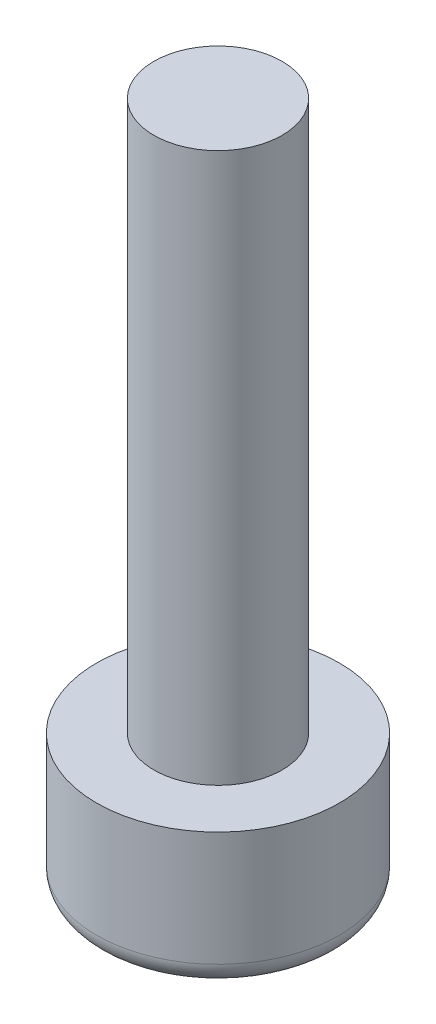
ISO-10303-21;
HEADER;
FILE_DESCRIPTION(('STEP AP214'),'2;1');
FILE_NAME('part.step','',(''),(''),'','','');
FILE_SCHEMA(('AUTOMOTIVE_DESIGN { 1 0 10303 214 1 1 1 1 }'));
ENDSEC;
DATA;
#1=APPLICATION_CONTEXT('core data for automotive mechanical design processes');
#2=APPLICATION_PROTOCOL_DEFINITION('international standard','automotive_design',2000,#1);
#3=PRODUCT_CONTEXT('',#1,'mechanical');
#4=PRODUCT('Part','Part','',(#3));
#5=PRODUCT_RELATED_PRODUCT_CATEGORY('part','',(#4));
#6=PRODUCT_DEFINITION_FORMATION('','',#4);
#7=PRODUCT_DEFINITION_CONTEXT('part definition',#1,'design');
#8=PRODUCT_DEFINITION('design','',#6,#7);
#9=PRODUCT_DEFINITION_SHAPE('','',#8);
#10=(LENGTH_UNIT() NAMED_UNIT(*) SI_UNIT(.MILLI.,.METRE.));
#11=(NAMED_UNIT(*) PLANE_ANGLE_UNIT() SI_UNIT($,.RADIAN.));
#12=(NAMED_UNIT(*) SI_UNIT($,.STERADIAN.) SOLID_ANGLE_UNIT());
#13=UNCERTAINTY_MEASURE_WITH_UNIT(LENGTH_MEASURE(1.E-05),#10,'distance_accuracy_value','');
#14=(GEOMETRIC_REPRESENTATION_CONTEXT(3) GLOBAL_UNCERTAINTY_ASSIGNED_CONTEXT((#13)) GLOBAL_UNIT_ASSIGNED_CONTEXT((#10,
#11,#12)) REPRESENTATION_CONTEXT('',''));
#15=CARTESIAN_POINT('',(0.,0.,0.));
#16=DIRECTION('',(0.,0.,1.));
#17=DIRECTION('',(1.,0.,0.));
#18=AXIS2_PLACEMENT_3D('',#15,#16,#17);
#19=CARTESIAN_POINT('',(0.,0.,0.));
#20=DIRECTION('',(0.,-1.,0.));
#21=DIRECTION('',(0.,0.,-1.));
#22=AXIS2_PLACEMENT_3D('',#19,#20,#21);
#23=PLANE('',#22);
#24=CARTESIAN_POINT('',(0.,0.,0.));
#25=DIRECTION('',(0.,-1.,0.));
#26=DIRECTION('',(0.,0.,-1.));
#27=AXIS2_PLACEMENT_3D('',#24,#25,#26);
#28=CIRCLE('',#27,2.15);
#29=CARTESIAN_POINT('',(0.,0.,-2.15));
#30=VERTEX_POINT('',#29);
#31=EDGE_CURVE('E52',#30,#30,#28,.T.);
#32=ORIENTED_EDGE('',*,*,#31,.T.);
#33=EDGE_LOOP('',(#32));
#34=FACE_BOUND('',#33,.T.);
#35=CARTESIAN_POINT('',(0.,0.,0.));
#36=DIRECTION('',(0.,-1.,0.));
#37=DIRECTION('',(0.,0.,-1.));
#38=AXIS2_PLACEMENT_3D('',#35,#36,#37);
#39=CIRCLE('',#38,1.75);
#40=CARTESIAN_POINT('',(0.,0.,-1.75));
#41=VERTEX_POINT('',#40);
#42=EDGE_CURVE('E192',#41,#41,#39,.T.);
#43=ORIENTED_EDGE('',*,*,#42,.F.);
#44=EDGE_LOOP('',(#43));
#45=FACE_BOUND('',#44,.T.);
#46=ADVANCED_FACE('F44',(#34,#45),#23,.T.);
#47=CARTESIAN_POINT('',(0.,0.,0.));
#48=DIRECTION('',(0.,-1.,0.));
#49=DIRECTION('',(0.,0.,-1.));
#50=AXIS2_PLACEMENT_3D('',#47,#48,#49);
#51=CYLINDRICAL_SURFACE('',#50,2.65);
#52=CARTESIAN_POINT('',(0.,0.5,0.));
#53=DIRECTION('',(0.,-1.,0.));
#54=DIRECTION('',(0.,0.,-1.));
#55=AXIS2_PLACEMENT_3D('',#52,#53,#54);
#56=CIRCLE('',#55,2.65);
#57=CARTESIAN_POINT('',(0.,0.5,-2.65));
#58=VERTEX_POINT('',#57);
#59=EDGE_CURVE('E11',#58,#58,#56,.F.);
#60=ORIENTED_EDGE('',*,*,#59,.T.);
#61=EDGE_LOOP('',(#60));
#62=FACE_BOUND('',#61,.T.);
#63=CARTESIAN_POINT('',(0.,3.,0.));
#64=DIRECTION('',(0.,-1.,0.));
#65=DIRECTION('',(0.,0.,-1.));
#66=AXIS2_PLACEMENT_3D('',#63,#64,#65);
#67=CIRCLE('',#66,2.65);
#68=CARTESIAN_POINT('',(0.,3.,-2.65));
#69=VERTEX_POINT('',#68);
#70=EDGE_CURVE('E103',#69,#69,#67,.T.);
#71=ORIENTED_EDGE('',*,*,#70,.T.);
#72=EDGE_LOOP('',(#71));
#73=FACE_BOUND('',#72,.T.);
#74=ADVANCED_FACE('F148',(#62,#73),#51,.T.);
#75=CARTESIAN_POINT('',(2.65,3.,0.));
#76=DIRECTION('',(0.,1.,0.));
#77=DIRECTION('',(0.,0.,1.));
#78=AXIS2_PLACEMENT_3D('',#75,#76,#77);
#79=PLANE('',#78);
#80=CARTESIAN_POINT('',(0.,3.,0.));
#81=DIRECTION('',(0.,-1.,0.));
#82=DIRECTION('',(0.,0.,-1.));
#83=AXIS2_PLACEMENT_3D('',#80,#81,#82);
#84=CIRCLE('',#83,1.4);
#85=CARTESIAN_POINT('',(0.,3.,-1.4));
#86=VERTEX_POINT('',#85);
#87=EDGE_CURVE('E129',#86,#86,#84,.T.);
#88=ORIENTED_EDGE('',*,*,#87,.T.);
#89=EDGE_LOOP('',(#88));
#90=FACE_BOUND('',#89,.T.);
#91=ORIENTED_EDGE('',*,*,#70,.F.);
#92=EDGE_LOOP('',(#91));
#93=FACE_BOUND('',#92,.T.);
#94=ADVANCED_FACE('F151',(#90,#93),#79,.T.);
#95=CARTESIAN_POINT('',(0.,0.,0.));
#96=DIRECTION('',(0.,-1.,0.));
#97=DIRECTION('',(0.,0.,-1.));
#98=AXIS2_PLACEMENT_3D('',#95,#96,#97);
#99=CYLINDRICAL_SURFACE('',#98,1.4);
#100=CARTESIAN_POINT('',(0.,15.,0.));
#101=DIRECTION('',(0.,-1.,0.));
#102=DIRECTION('',(0.,0.,-1.));
#103=AXIS2_PLACEMENT_3D('',#100,#101,#102);
#104=CIRCLE('',#103,1.4);
#105=CARTESIAN_POINT('',(0.,15.,-1.4));
#106=VERTEX_POINT('',#105);
#107=EDGE_CURVE('E126',#106,#106,#104,.T.);
#108=ORIENTED_EDGE('',*,*,#107,.T.);
#109=EDGE_LOOP('',(#108));
#110=FACE_BOUND('',#109,.T.);
#111=ORIENTED_EDGE('',*,*,#87,.F.);
#112=EDGE_LOOP('',(#111));
#113=FACE_BOUND('',#112,.T.);
#114=ADVANCED_FACE('F157',(#110,#113),#99,.T.);
#115=CARTESIAN_POINT('',(1.4,15.,0.));
#116=DIRECTION('',(0.,1.,0.));
#117=DIRECTION('',(0.,0.,1.));
#118=AXIS2_PLACEMENT_3D('',#115,#116,#117);
#119=PLANE('',#118);
#120=ORIENTED_EDGE('',*,*,#107,.F.);
#121=EDGE_LOOP('',(#120));
#122=FACE_BOUND('',#121,.T.);
#123=ADVANCED_FACE('F161',(#122),#119,.T.);
#124=CARTESIAN_POINT('',(0.,-4.95416666666666,0.));
#125=DIRECTION('',(0.,-1.,0.));
#126=DIRECTION('',(1.,0.,0.));
#127=AXIS2_PLACEMENT_3D('',#124,#125,#126);
#128=SPHERICAL_SURFACE('',#127,5.25416666666666);
#129=ORIENTED_EDGE('',*,*,#42,.T.);
#130=EDGE_LOOP('',(#129));
#131=FACE_BOUND('',#130,.T.);
#132=CARTESIAN_POINT('',(-1.08253175473055,-4.95416666666666,0.625));
#133=DIRECTION('',(-0.866025403784439,0.,0.5));
#134=DIRECTION('',(0.5,0.,0.866025403784439));
#135=AXIS2_PLACEMENT_3D('',#132,#133,#134);
#136=CIRCLE('',#135,5.10330945182742);
#137=CARTESIAN_POINT('',(-1.44337567297406,0.0978560992932979,0.));
#138=VERTEX_POINT('',#137);
#139=CARTESIAN_POINT('',(-0.721687836487032,0.0978560992932979,1.25));
#140=VERTEX_POINT('',#139);
#141=EDGE_CURVE('E99',#138,#140,#136,.F.);
#142=ORIENTED_EDGE('',*,*,#141,.T.);
#143=CARTESIAN_POINT('',(0.,-4.95416666666666,1.25));
#144=DIRECTION('',(0.,0.,1.));
#145=DIRECTION('',(1.,0.,0.));
#146=AXIS2_PLACEMENT_3D('',#143,#144,#145);
#147=CIRCLE('',#146,5.10330945182742);
#148=CARTESIAN_POINT('',(0.721687836487031,0.0978560992932987,1.25));
#149=VERTEX_POINT('',#148);
#150=EDGE_CURVE('E110',#140,#149,#147,.F.);
#151=ORIENTED_EDGE('',*,*,#150,.T.);
#152=CARTESIAN_POINT('',(1.08253175473055,-4.95416666666666,0.625));
#153=DIRECTION('',(0.866025403784439,0.,0.5));
#154=DIRECTION('',(0.5,0.,-0.866025403784439));
#155=AXIS2_PLACEMENT_3D('',#152,#153,#154);
#156=CIRCLE('',#155,5.10330945182742);
#157=CARTESIAN_POINT('',(1.44337567297406,0.0978560992932987,0.));
#158=VERTEX_POINT('',#157);
#159=EDGE_CURVE('E198',#149,#158,#156,.F.);
#160=ORIENTED_EDGE('',*,*,#159,.T.);
#161=CARTESIAN_POINT('',(1.08253175473055,-4.95416666666666,-0.625));
#162=DIRECTION('',(0.866025403784439,0.,-0.5));
#163=DIRECTION('',(-0.5,0.,-0.866025403784439));
#164=AXIS2_PLACEMENT_3D('',#161,#162,#163);
#165=CIRCLE('',#164,5.10330945182742);
#166=CARTESIAN_POINT('',(0.721687836487031,0.0978560992932979,-1.25));
#167=VERTEX_POINT('',#166);
#168=EDGE_CURVE('E194',#158,#167,#165,.F.);
#169=ORIENTED_EDGE('',*,*,#168,.T.);
#170=CARTESIAN_POINT('',(0.,-4.95416666666666,-1.25));
#171=DIRECTION('',(0.,0.,-1.));
#172=DIRECTION('',(-1.,0.,0.));
#173=AXIS2_PLACEMENT_3D('',#170,#171,#172);
#174=CIRCLE('',#173,5.10330945182742);
#175=CARTESIAN_POINT('',(-0.721687836487032,0.0978560992932979,-1.25));
#176=VERTEX_POINT('',#175);
#177=EDGE_CURVE('E59',#167,#176,#174,.F.);
#178=ORIENTED_EDGE('',*,*,#177,.T.);
#179=CARTESIAN_POINT('',(-1.08253175473055,-4.95416666666666,-0.625));
#180=DIRECTION('',(-0.866025403784439,0.,-0.5));
#181=DIRECTION('',(-0.5,0.,0.866025403784439));
#182=AXIS2_PLACEMENT_3D('',#179,#180,#181);
#183=CIRCLE('',#182,5.10330945182742);
#184=EDGE_CURVE('E96',#176,#138,#183,.F.);
#185=ORIENTED_EDGE('',*,*,#184,.T.);
#186=EDGE_LOOP('',(#142,#151,#160,#169,#178,#185));
#187=FACE_BOUND('',#186,.T.);
#188=ADVANCED_FACE('F98',(#131,#187),#128,.F.);
#189=CARTESIAN_POINT('',(0.,2.,0.));
#190=DIRECTION('',(0.,-1.,0.));
#191=DIRECTION('',(0.,0.,-1.));
#192=AXIS2_PLACEMENT_3D('',#189,#190,#191);
#193=PLANE('',#192);
#194=DIRECTION('',(-0.5,0.,-0.866025403784439));
#195=VECTOR('',#194,1.);
#196=CARTESIAN_POINT('',(-0.721687836487032,2.,1.25));
#197=LINE('',#196,#195);
#198=CARTESIAN_POINT('',(-0.721687836487032,2.,1.25));
#199=VERTEX_POINT('',#198);
#200=CARTESIAN_POINT('',(-1.44337567297406,2.,0.));
#201=VERTEX_POINT('',#200);
#202=EDGE_CURVE('E109',#199,#201,#197,.T.);
#203=ORIENTED_EDGE('',*,*,#202,.T.);
#204=DIRECTION('',(0.5,0.,-0.866025403784439));
#205=VECTOR('',#204,1.);
#206=CARTESIAN_POINT('',(-1.44337567297406,2.,0.));
#207=LINE('',#206,#205);
#208=CARTESIAN_POINT('',(-0.721687836487032,2.,-1.25));
#209=VERTEX_POINT('',#208);
#210=EDGE_CURVE('E114',#201,#209,#207,.T.);
#211=ORIENTED_EDGE('',*,*,#210,.T.);
#212=DIRECTION('',(1.,0.,0.));
#213=VECTOR('',#212,1.);
#214=CARTESIAN_POINT('',(-0.721687836487032,2.,-1.25));
#215=LINE('',#214,#213);
#216=CARTESIAN_POINT('',(0.721687836487031,2.,-1.25));
#217=VERTEX_POINT('',#216);
#218=EDGE_CURVE('E203',#209,#217,#215,.T.);
#219=ORIENTED_EDGE('',*,*,#218,.T.);
#220=DIRECTION('',(0.5,0.,0.866025403784439));
#221=VECTOR('',#220,1.);
#222=CARTESIAN_POINT('',(0.721687836487031,2.,-1.25));
#223=LINE('',#222,#221);
#224=CARTESIAN_POINT('',(1.44337567297406,2.,0.));
#225=VERTEX_POINT('',#224);
#226=EDGE_CURVE('E206',#217,#225,#223,.T.);
#227=ORIENTED_EDGE('',*,*,#226,.T.);
#228=DIRECTION('',(-0.5,0.,0.866025403784439));
#229=VECTOR('',#228,1.);
#230=CARTESIAN_POINT('',(1.44337567297406,2.,0.));
#231=LINE('',#230,#229);
#232=CARTESIAN_POINT('',(0.721687836487031,2.,1.25));
#233=VERTEX_POINT('',#232);
#234=EDGE_CURVE('E122',#225,#233,#231,.T.);
#235=ORIENTED_EDGE('',*,*,#234,.T.);
#236=DIRECTION('',(-1.,0.,0.));
#237=VECTOR('',#236,1.);
#238=CARTESIAN_POINT('',(0.721687836487031,2.,1.25));
#239=LINE('',#238,#237);
#240=EDGE_CURVE('E117',#233,#199,#239,.T.);
#241=ORIENTED_EDGE('',*,*,#240,.T.);
#242=EDGE_LOOP('',(#203,#211,#219,#227,#235,#241));
#243=FACE_BOUND('',#242,.T.);
#244=ADVANCED_FACE('F169',(#243),#193,.T.);
#245=CARTESIAN_POINT('',(-1.44337567297406,2.,0.));
#246=DIRECTION('',(-0.866025403784439,0.,-0.5));
#247=DIRECTION('',(-0.5,0.,0.866025403784439));
#248=AXIS2_PLACEMENT_3D('',#245,#246,#247);
#249=PLANE('',#248);
#250=ORIENTED_EDGE('',*,*,#184,.F.);
#251=DIRECTION('',(0.,-1.,0.));
#252=VECTOR('',#251,1.);
#253=CARTESIAN_POINT('',(-0.721687836487032,2.,-1.25));
#254=LINE('',#253,#252);
#255=EDGE_CURVE('E116',#209,#176,#254,.T.);
#256=ORIENTED_EDGE('',*,*,#255,.F.);
#257=ORIENTED_EDGE('',*,*,#210,.F.);
#258=DIRECTION('',(0.,-1.,0.));
#259=VECTOR('',#258,1.);
#260=CARTESIAN_POINT('',(-1.44337567297406,2.,0.));
#261=LINE('',#260,#259);
#262=EDGE_CURVE('E107',#201,#138,#261,.T.);
#263=ORIENTED_EDGE('',*,*,#262,.T.);
#264=EDGE_LOOP('',(#250,#256,#257,#263));
#265=FACE_BOUND('',#264,.T.);
#266=ADVANCED_FACE('F112',(#265),#249,.F.);
#267=CARTESIAN_POINT('',(-0.721687836487032,2.,-1.25));
#268=DIRECTION('',(0.,0.,-1.));
#269=DIRECTION('',(-1.,0.,0.));
#270=AXIS2_PLACEMENT_3D('',#267,#268,#269);
#271=PLANE('',#270);
#272=ORIENTED_EDGE('',*,*,#177,.F.);
#273=DIRECTION('',(0.,-1.,0.));
#274=VECTOR('',#273,1.);
#275=CARTESIAN_POINT('',(0.721687836487031,2.,-1.25));
#276=LINE('',#275,#274);
#277=EDGE_CURVE('E119',#217,#167,#276,.T.);
#278=ORIENTED_EDGE('',*,*,#277,.F.);
#279=ORIENTED_EDGE('',*,*,#218,.F.);
#280=ORIENTED_EDGE('',*,*,#255,.T.);
#281=EDGE_LOOP('',(#272,#278,#279,#280));
#282=FACE_BOUND('',#281,.T.);
#283=ADVANCED_FACE('F168',(#282),#271,.F.);
#284=CARTESIAN_POINT('',(0.721687836487031,2.,-1.25));
#285=DIRECTION('',(0.866025403784439,0.,-0.5));
#286=DIRECTION('',(-0.5,0.,-0.866025403784439));
#287=AXIS2_PLACEMENT_3D('',#284,#285,#286);
#288=PLANE('',#287);
#289=ORIENTED_EDGE('',*,*,#168,.F.);
#290=DIRECTION('',(0.,-1.,0.));
#291=VECTOR('',#290,1.);
#292=CARTESIAN_POINT('',(1.44337567297406,2.,0.));
#293=LINE('',#292,#291);
#294=EDGE_CURVE('E215',#225,#158,#293,.T.);
#295=ORIENTED_EDGE('',*,*,#294,.F.);
#296=ORIENTED_EDGE('',*,*,#226,.F.);
#297=ORIENTED_EDGE('',*,*,#277,.T.);
#298=EDGE_LOOP('',(#289,#295,#296,#297));
#299=FACE_BOUND('',#298,.T.);
#300=ADVANCED_FACE('F172',(#299),#288,.F.);
#301=CARTESIAN_POINT('',(1.44337567297406,2.,0.));
#302=DIRECTION('',(0.866025403784439,0.,0.5));
#303=DIRECTION('',(0.5,0.,-0.866025403784439));
#304=AXIS2_PLACEMENT_3D('',#301,#302,#303);
#305=PLANE('',#304);
#306=ORIENTED_EDGE('',*,*,#159,.F.);
#307=DIRECTION('',(0.,-1.,0.));
#308=VECTOR('',#307,1.);
#309=CARTESIAN_POINT('',(0.721687836487031,2.,1.25));
#310=LINE('',#309,#308);
#311=EDGE_CURVE('E212',#233,#149,#310,.T.);
#312=ORIENTED_EDGE('',*,*,#311,.F.);
#313=ORIENTED_EDGE('',*,*,#234,.F.);
#314=ORIENTED_EDGE('',*,*,#294,.T.);
#315=EDGE_LOOP('',(#306,#312,#313,#314));
#316=FACE_BOUND('',#315,.T.);
#317=ADVANCED_FACE('F176',(#316),#305,.F.);
#318=CARTESIAN_POINT('',(0.721687836487031,2.,1.25));
#319=DIRECTION('',(0.,0.,1.));
#320=DIRECTION('',(1.,0.,0.));
#321=AXIS2_PLACEMENT_3D('',#318,#319,#320);
#322=PLANE('',#321);
#323=ORIENTED_EDGE('',*,*,#150,.F.);
#324=DIRECTION('',(0.,-1.,0.));
#325=VECTOR('',#324,1.);
#326=CARTESIAN_POINT('',(-0.721687836487032,2.,1.25));
#327=LINE('',#326,#325);
#328=EDGE_CURVE('E67',#199,#140,#327,.T.);
#329=ORIENTED_EDGE('',*,*,#328,.F.);
#330=ORIENTED_EDGE('',*,*,#240,.F.);
#331=ORIENTED_EDGE('',*,*,#311,.T.);
#332=EDGE_LOOP('',(#323,#329,#330,#331));
#333=FACE_BOUND('',#332,.T.);
#334=ADVANCED_FACE('F144',(#333),#322,.F.);
#335=CARTESIAN_POINT('',(-0.721687836487032,2.,1.25));
#336=DIRECTION('',(-0.866025403784439,0.,0.5));
#337=DIRECTION('',(0.5,0.,0.866025403784439));
#338=AXIS2_PLACEMENT_3D('',#335,#336,#337);
#339=PLANE('',#338);
#340=ORIENTED_EDGE('',*,*,#141,.F.);
#341=ORIENTED_EDGE('',*,*,#262,.F.);
#342=ORIENTED_EDGE('',*,*,#202,.F.);
#343=ORIENTED_EDGE('',*,*,#328,.T.);
#344=EDGE_LOOP('',(#340,#341,#342,#343));
#345=FACE_BOUND('',#344,.T.);
#346=ADVANCED_FACE('F106',(#345),#339,.F.);
#347=CARTESIAN_POINT('',(0.,0.5,0.));
#348=DIRECTION('',(0.,-1.,0.));
#349=DIRECTION('',(0.,0.,-1.));
#350=AXIS2_PLACEMENT_3D('',#347,#348,#349);
#351=TOROIDAL_SURFACE('',#350,2.15,0.5);
#352=ORIENTED_EDGE('',*,*,#59,.F.);
#353=EDGE_LOOP('',(#352));
#354=FACE_BOUND('',#353,.T.);
#355=ORIENTED_EDGE('',*,*,#31,.F.);
#356=EDGE_LOOP('',(#355));
#357=FACE_BOUND('',#356,.T.);
#358=ADVANCED_FACE('F46',(#354,#357),#351,.T.);
#359=CLOSED_SHELL('',(#46,#74,#94,#114,#123,#188,#244,#266,#283,#300,#317,#334,#346,#358));
#360=MANIFOLD_SOLID_BREP('B2',#359);
#361=ADVANCED_BREP_SHAPE_REPRESENTATION('',(#18,#360),#14);
#362=SHAPE_DEFINITION_REPRESENTATION(#9,#361);
ENDSEC;
END-ISO-10303-21;
